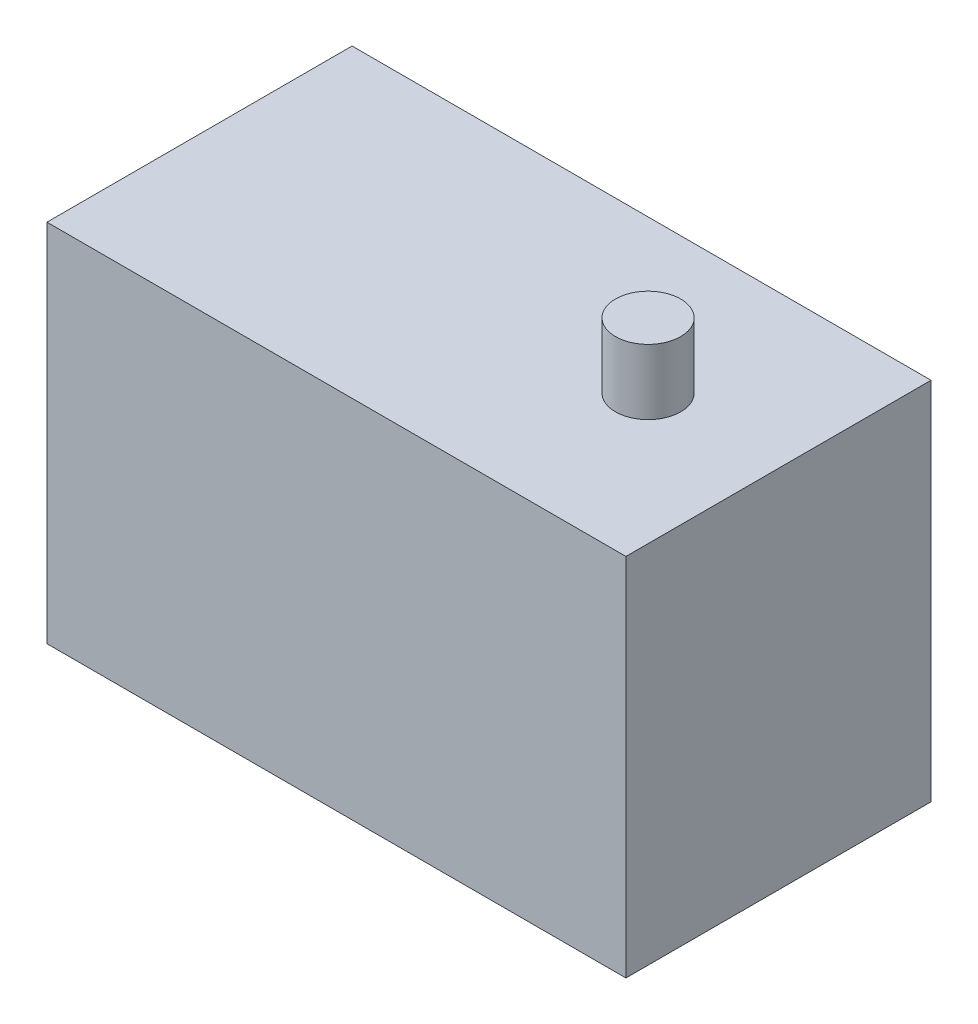
ISO-10303-21;
HEADER;
FILE_DESCRIPTION(('STEP AP214'),'2;1');
FILE_NAME('part.step','',(''),(''),'','','');
FILE_SCHEMA(('AUTOMOTIVE_DESIGN { 1 0 10303 214 1 1 1 1 }'));
ENDSEC;
DATA;
#1=APPLICATION_CONTEXT('core data for automotive mechanical design processes');
#2=APPLICATION_PROTOCOL_DEFINITION('international standard','automotive_design',2000,#1);
#3=PRODUCT_CONTEXT('',#1,'mechanical');
#4=PRODUCT('Part','Part','',(#3));
#5=PRODUCT_RELATED_PRODUCT_CATEGORY('part','',(#4));
#6=PRODUCT_DEFINITION_FORMATION('','',#4);
#7=PRODUCT_DEFINITION_CONTEXT('part definition',#1,'design');
#8=PRODUCT_DEFINITION('design','',#6,#7);
#9=PRODUCT_DEFINITION_SHAPE('','',#8);
#10=(LENGTH_UNIT() NAMED_UNIT(*) SI_UNIT(.MILLI.,.METRE.));
#11=(NAMED_UNIT(*) PLANE_ANGLE_UNIT() SI_UNIT($,.RADIAN.));
#12=(NAMED_UNIT(*) SI_UNIT($,.STERADIAN.) SOLID_ANGLE_UNIT());
#13=UNCERTAINTY_MEASURE_WITH_UNIT(LENGTH_MEASURE(1.E-05),#10,'distance_accuracy_value','');
#14=(GEOMETRIC_REPRESENTATION_CONTEXT(3) GLOBAL_UNCERTAINTY_ASSIGNED_CONTEXT((#13)) GLOBAL_UNIT_ASSIGNED_CONTEXT((#10,
#11,#12)) REPRESENTATION_CONTEXT('',''));
#15=CARTESIAN_POINT('',(0.,0.,0.));
#16=DIRECTION('',(0.,0.,1.));
#17=DIRECTION('',(1.,0.,0.));
#18=AXIS2_PLACEMENT_3D('',#15,#16,#17);
#19=CARTESIAN_POINT('',(-42.1477832512315,28.,-23.1931034482759));
#20=DIRECTION('',(1.,0.,0.));
#21=DIRECTION('',(0.,0.,-1.));
#22=AXIS2_PLACEMENT_3D('',#19,#20,#21);
#23=PLANE('',#22);
#24=DIRECTION('',(0.,0.,1.));
#25=VECTOR('',#24,1.);
#26=CARTESIAN_POINT('',(-42.1477832512315,0.,-23.1931034482759));
#27=LINE('',#26,#25);
#28=CARTESIAN_POINT('',(-42.1477832512315,0.,-23.1931034482759));
#29=VERTEX_POINT('',#28);
#30=CARTESIAN_POINT('',(-42.1477832512315,0.,0.20689655172414));
#31=VERTEX_POINT('',#30);
#32=EDGE_CURVE('E104',#29,#31,#27,.T.);
#33=ORIENTED_EDGE('',*,*,#32,.T.);
#34=DIRECTION('',(0.,-1.,0.));
#35=VECTOR('',#34,1.);
#36=CARTESIAN_POINT('',(-42.1477832512315,28.,0.20689655172414));
#37=LINE('',#36,#35);
#38=CARTESIAN_POINT('',(-42.1477832512315,28.,0.20689655172414));
#39=VERTEX_POINT('',#38);
#40=EDGE_CURVE('E46',#39,#31,#37,.T.);
#41=ORIENTED_EDGE('',*,*,#40,.F.);
#42=DIRECTION('',(0.,0.,1.));
#43=VECTOR('',#42,1.);
#44=CARTESIAN_POINT('',(-42.1477832512315,28.,-23.1931034482759));
#45=LINE('',#44,#43);
#46=CARTESIAN_POINT('',(-42.1477832512315,28.,-23.1931034482759));
#47=VERTEX_POINT('',#46);
#48=EDGE_CURVE('E90',#47,#39,#45,.T.);
#49=ORIENTED_EDGE('',*,*,#48,.F.);
#50=DIRECTION('',(0.,-1.,0.));
#51=VECTOR('',#50,1.);
#52=CARTESIAN_POINT('',(-42.1477832512315,28.,-23.1931034482759));
#53=LINE('',#52,#51);
#54=EDGE_CURVE('E100',#47,#29,#53,.T.);
#55=ORIENTED_EDGE('',*,*,#54,.T.);
#56=EDGE_LOOP('',(#33,#41,#49,#55));
#57=FACE_BOUND('',#56,.T.);
#58=ADVANCED_FACE('F38',(#57),#23,.F.);
#59=CARTESIAN_POINT('',(-42.1477832512315,28.,0.20689655172414));
#60=DIRECTION('',(0.,0.,-1.));
#61=DIRECTION('',(-1.,0.,0.));
#62=AXIS2_PLACEMENT_3D('',#59,#60,#61);
#63=PLANE('',#62);
#64=DIRECTION('',(1.,0.,0.));
#65=VECTOR('',#64,1.);
#66=CARTESIAN_POINT('',(-42.1477832512315,0.,0.20689655172414));
#67=LINE('',#66,#65);
#68=CARTESIAN_POINT('',(2.25221674876847,0.,0.20689655172414));
#69=VERTEX_POINT('',#68);
#70=EDGE_CURVE('E95',#31,#69,#67,.T.);
#71=ORIENTED_EDGE('',*,*,#70,.T.);
#72=DIRECTION('',(0.,-1.,0.));
#73=VECTOR('',#72,1.);
#74=CARTESIAN_POINT('',(2.25221674876847,28.,0.20689655172414));
#75=LINE('',#74,#73);
#76=CARTESIAN_POINT('',(2.25221674876847,28.,0.20689655172414));
#77=VERTEX_POINT('',#76);
#78=EDGE_CURVE('E93',#77,#69,#75,.T.);
#79=ORIENTED_EDGE('',*,*,#78,.F.);
#80=DIRECTION('',(1.,0.,0.));
#81=VECTOR('',#80,1.);
#82=CARTESIAN_POINT('',(-42.1477832512315,28.,0.20689655172414));
#83=LINE('',#82,#81);
#84=EDGE_CURVE('E85',#39,#77,#83,.T.);
#85=ORIENTED_EDGE('',*,*,#84,.F.);
#86=ORIENTED_EDGE('',*,*,#40,.T.);
#87=EDGE_LOOP('',(#71,#79,#85,#86));
#88=FACE_BOUND('',#87,.T.);
#89=ADVANCED_FACE('F94',(#88),#63,.F.);
#90=CARTESIAN_POINT('',(2.25221674876847,28.,-23.1931034482759));
#91=DIRECTION('',(-1.,0.,0.));
#92=DIRECTION('',(0.,0.,1.));
#93=AXIS2_PLACEMENT_3D('',#90,#91,#92);
#94=PLANE('',#93);
#95=DIRECTION('',(0.,0.,-1.));
#96=VECTOR('',#95,1.);
#97=CARTESIAN_POINT('',(2.25221674876847,0.,-23.1931034482759));
#98=LINE('',#97,#96);
#99=CARTESIAN_POINT('',(2.25221674876847,0.,-23.1931034482759));
#100=VERTEX_POINT('',#99);
#101=EDGE_CURVE('E71',#69,#100,#98,.T.);
#102=ORIENTED_EDGE('',*,*,#101,.T.);
#103=DIRECTION('',(0.,-1.,0.));
#104=VECTOR('',#103,1.);
#105=CARTESIAN_POINT('',(2.25221674876847,28.,-23.1931034482759));
#106=LINE('',#105,#104);
#107=CARTESIAN_POINT('',(2.25221674876847,28.,-23.1931034482759));
#108=VERTEX_POINT('',#107);
#109=EDGE_CURVE('E96',#108,#100,#106,.T.);
#110=ORIENTED_EDGE('',*,*,#109,.F.);
#111=DIRECTION('',(0.,0.,-1.));
#112=VECTOR('',#111,1.);
#113=CARTESIAN_POINT('',(2.25221674876847,28.,-23.1931034482759));
#114=LINE('',#113,#112);
#115=EDGE_CURVE('E88',#77,#108,#114,.T.);
#116=ORIENTED_EDGE('',*,*,#115,.F.);
#117=ORIENTED_EDGE('',*,*,#78,.T.);
#118=EDGE_LOOP('',(#102,#110,#116,#117));
#119=FACE_BOUND('',#118,.T.);
#120=ADVANCED_FACE('F98',(#119),#94,.F.);
#121=CARTESIAN_POINT('',(-42.1477832512315,28.,-23.1931034482759));
#122=DIRECTION('',(0.,0.,1.));
#123=DIRECTION('',(1.,0.,0.));
#124=AXIS2_PLACEMENT_3D('',#121,#122,#123);
#125=PLANE('',#124);
#126=DIRECTION('',(-1.,0.,0.));
#127=VECTOR('',#126,1.);
#128=CARTESIAN_POINT('',(-42.1477832512315,0.,-23.1931034482759));
#129=LINE('',#128,#127);
#130=EDGE_CURVE('E77',#100,#29,#129,.T.);
#131=ORIENTED_EDGE('',*,*,#130,.T.);
#132=ORIENTED_EDGE('',*,*,#54,.F.);
#133=DIRECTION('',(-1.,0.,0.));
#134=VECTOR('',#133,1.);
#135=CARTESIAN_POINT('',(-42.1477832512315,28.,-23.1931034482759));
#136=LINE('',#135,#134);
#137=EDGE_CURVE('E54',#108,#47,#136,.T.);
#138=ORIENTED_EDGE('',*,*,#137,.F.);
#139=ORIENTED_EDGE('',*,*,#109,.T.);
#140=EDGE_LOOP('',(#131,#132,#138,#139));
#141=FACE_BOUND('',#140,.T.);
#142=ADVANCED_FACE('F127',(#141),#125,.F.);
#143=CARTESIAN_POINT('',(0.,28.,0.));
#144=DIRECTION('',(0.,1.,0.));
#145=DIRECTION('',(0.,0.,1.));
#146=AXIS2_PLACEMENT_3D('',#143,#144,#145);
#147=PLANE('',#146);
#148=CARTESIAN_POINT('',(-7.74778325123153,28.,-11.4931034482759));
#149=DIRECTION('',(0.,1.,0.));
#150=DIRECTION('',(0.,0.,1.));
#151=AXIS2_PLACEMENT_3D('',#148,#149,#150);
#152=CIRCLE('',#151,2.5);
#153=CARTESIAN_POINT('',(-7.74778325123153,28.,-8.99310344827585));
#154=VERTEX_POINT('',#153);
#155=EDGE_CURVE('E11',#154,#154,#152,.T.);
#156=ORIENTED_EDGE('',*,*,#155,.F.);
#157=EDGE_LOOP('',(#156));
#158=FACE_BOUND('',#157,.T.);
#159=ORIENTED_EDGE('',*,*,#48,.T.);
#160=ORIENTED_EDGE('',*,*,#84,.T.);
#161=ORIENTED_EDGE('',*,*,#115,.T.);
#162=ORIENTED_EDGE('',*,*,#137,.T.);
#163=EDGE_LOOP('',(#159,#160,#161,#162));
#164=FACE_BOUND('',#163,.T.);
#165=ADVANCED_FACE('F86',(#158,#164),#147,.T.);
#166=CARTESIAN_POINT('',(0.,0.,0.));
#167=DIRECTION('',(0.,1.,0.));
#168=DIRECTION('',(0.,0.,1.));
#169=AXIS2_PLACEMENT_3D('',#166,#167,#168);
#170=PLANE('',#169);
#171=CARTESIAN_POINT('',(-7.74778325123153,0.,-11.4931034482759));
#172=DIRECTION('',(0.,1.,0.));
#173=DIRECTION('',(0.,0.,1.));
#174=AXIS2_PLACEMENT_3D('',#171,#172,#173);
#175=CIRCLE('',#174,2.5);
#176=CARTESIAN_POINT('',(-7.74778325123153,0.,-8.99310344827585));
#177=VERTEX_POINT('',#176);
#178=EDGE_CURVE('E185',#177,#177,#175,.T.);
#179=ORIENTED_EDGE('',*,*,#178,.T.);
#180=EDGE_LOOP('',(#179));
#181=FACE_BOUND('',#180,.T.);
#182=ORIENTED_EDGE('',*,*,#32,.F.);
#183=ORIENTED_EDGE('',*,*,#130,.F.);
#184=ORIENTED_EDGE('',*,*,#101,.F.);
#185=ORIENTED_EDGE('',*,*,#70,.F.);
#186=EDGE_LOOP('',(#182,#183,#184,#185));
#187=FACE_BOUND('',#186,.T.);
#188=ADVANCED_FACE('F115',(#181,#187),#170,.F.);
#189=CARTESIAN_POINT('',(-7.74778325123153,-5.,-11.4931034482759));
#190=DIRECTION('',(0.,1.,0.));
#191=DIRECTION('',(0.,0.,1.));
#192=AXIS2_PLACEMENT_3D('',#189,#190,#191);
#193=CYLINDRICAL_SURFACE('',#192,2.5);
#194=CARTESIAN_POINT('',(-7.74778325123153,-5.,-11.4931034482759));
#195=DIRECTION('',(0.,1.,0.));
#196=DIRECTION('',(0.,0.,1.));
#197=AXIS2_PLACEMENT_3D('',#194,#195,#196);
#198=CIRCLE('',#197,2.5);
#199=CARTESIAN_POINT('',(-7.74778325123153,-5.,-8.99310344827585));
#200=VERTEX_POINT('',#199);
#201=EDGE_CURVE('E107',#200,#200,#198,.T.);
#202=ORIENTED_EDGE('',*,*,#201,.T.);
#203=EDGE_LOOP('',(#202));
#204=FACE_BOUND('',#203,.T.);
#205=ORIENTED_EDGE('',*,*,#178,.F.);
#206=EDGE_LOOP('',(#205));
#207=FACE_BOUND('',#206,.T.);
#208=ADVANCED_FACE('F117',(#204,#207),#193,.T.);
#209=CARTESIAN_POINT('',(-7.74778325123153,-5.,-11.4931034482759));
#210=DIRECTION('',(0.,1.,0.));
#211=DIRECTION('',(0.,0.,1.));
#212=AXIS2_PLACEMENT_3D('',#209,#210,#211);
#213=PLANE('',#212);
#214=ORIENTED_EDGE('',*,*,#201,.F.);
#215=EDGE_LOOP('',(#214));
#216=FACE_BOUND('',#215,.T.);
#217=ADVANCED_FACE('F124',(#216),#213,.F.);
#218=CARTESIAN_POINT('',(-7.74778325123153,28.,-11.4931034482759));
#219=DIRECTION('',(0.,1.,0.));
#220=DIRECTION('',(0.,0.,1.));
#221=AXIS2_PLACEMENT_3D('',#218,#219,#220);
#222=CYLINDRICAL_SURFACE('',#221,2.5);
#223=ORIENTED_EDGE('',*,*,#155,.T.);
#224=EDGE_LOOP('',(#223));
#225=FACE_BOUND('',#224,.T.);
#226=CARTESIAN_POINT('',(-7.74778325123153,33.,-11.4931034482759));
#227=DIRECTION('',(0.,1.,0.));
#228=DIRECTION('',(0.,0.,1.));
#229=AXIS2_PLACEMENT_3D('',#226,#227,#228);
#230=CIRCLE('',#229,2.5);
#231=CARTESIAN_POINT('',(-7.74778325123153,33.,-8.99310344827585));
#232=VERTEX_POINT('',#231);
#233=EDGE_CURVE('E187',#232,#232,#230,.T.);
#234=ORIENTED_EDGE('',*,*,#233,.F.);
#235=EDGE_LOOP('',(#234));
#236=FACE_BOUND('',#235,.T.);
#237=ADVANCED_FACE('F160',(#225,#236),#222,.T.);
#238=CARTESIAN_POINT('',(-7.74778325123153,33.,-11.4931034482759));
#239=DIRECTION('',(0.,1.,0.));
#240=DIRECTION('',(0.,0.,1.));
#241=AXIS2_PLACEMENT_3D('',#238,#239,#240);
#242=PLANE('',#241);
#243=ORIENTED_EDGE('',*,*,#233,.T.);
#244=EDGE_LOOP('',(#243));
#245=FACE_BOUND('',#244,.T.);
#246=ADVANCED_FACE('F165',(#245),#242,.T.);
#247=CLOSED_SHELL('',(#58,#89,#120,#142,#165,#188,#208,#217,#237,#246));
#248=MANIFOLD_SOLID_BREP('B2',#247);
#249=ADVANCED_BREP_SHAPE_REPRESENTATION('',(#18,#248),#14);
#250=SHAPE_DEFINITION_REPRESENTATION(#9,#249);
ENDSEC;
END-ISO-10303-21;
